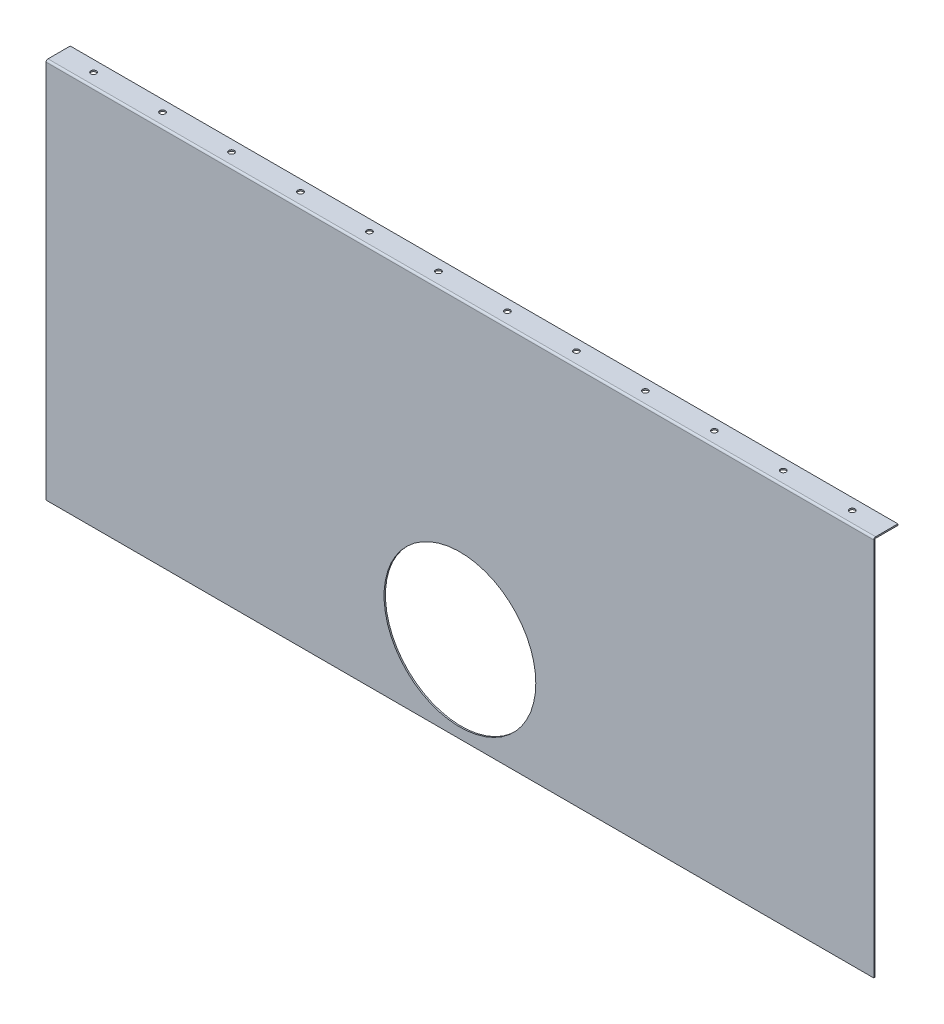
ISO-10303-21;
HEADER;
FILE_DESCRIPTION(('STEP AP214'),'2;1');
FILE_NAME('part.step','',(''),(''),'','','');
FILE_SCHEMA(('AUTOMOTIVE_DESIGN { 1 0 10303 214 1 1 1 1 }'));
ENDSEC;
DATA;
#1=APPLICATION_CONTEXT('core data for automotive mechanical design processes');
#2=APPLICATION_PROTOCOL_DEFINITION('international standard','automotive_design',2000,#1);
#3=PRODUCT_CONTEXT('',#1,'mechanical');
#4=PRODUCT('Part','Part','',(#3));
#5=PRODUCT_RELATED_PRODUCT_CATEGORY('part','',(#4));
#6=PRODUCT_DEFINITION_FORMATION('','',#4);
#7=PRODUCT_DEFINITION_CONTEXT('part definition',#1,'design');
#8=PRODUCT_DEFINITION('design','',#6,#7);
#9=PRODUCT_DEFINITION_SHAPE('','',#8);
#10=(LENGTH_UNIT() NAMED_UNIT(*) SI_UNIT(.MILLI.,.METRE.));
#11=(NAMED_UNIT(*) PLANE_ANGLE_UNIT() SI_UNIT($,.RADIAN.));
#12=(NAMED_UNIT(*) SI_UNIT($,.STERADIAN.) SOLID_ANGLE_UNIT());
#13=UNCERTAINTY_MEASURE_WITH_UNIT(LENGTH_MEASURE(1.E-05),#10,'distance_accuracy_value','');
#14=(GEOMETRIC_REPRESENTATION_CONTEXT(3) GLOBAL_UNCERTAINTY_ASSIGNED_CONTEXT((#13)) GLOBAL_UNIT_ASSIGNED_CONTEXT((#10,
#11,#12)) REPRESENTATION_CONTEXT('',''));
#15=CARTESIAN_POINT('',(0.,0.,0.));
#16=DIRECTION('',(0.,0.,1.));
#17=DIRECTION('',(1.,0.,0.));
#18=AXIS2_PLACEMENT_3D('',#15,#16,#17);
#19=CARTESIAN_POINT('',(-600.,-275.,-2.));
#20=DIRECTION('',(-1.,0.,0.));
#21=DIRECTION('',(0.,0.,1.));
#22=AXIS2_PLACEMENT_3D('',#19,#20,#21);
#23=PLANE('',#22);
#24=DIRECTION('',(0.,-1.,0.));
#25=VECTOR('',#24,1.);
#26=CARTESIAN_POINT('',(-600.,-275.,0.));
#27=LINE('',#26,#25);
#28=CARTESIAN_POINT('',(-600.,275.,0.));
#29=VERTEX_POINT('',#28);
#30=CARTESIAN_POINT('',(-600.,-275.,0.));
#31=VERTEX_POINT('',#30);
#32=EDGE_CURVE('E112',#29,#31,#27,.T.);
#33=ORIENTED_EDGE('',*,*,#32,.F.);
#34=DIRECTION('',(0.,0.,1.));
#35=VECTOR('',#34,1.);
#36=CARTESIAN_POINT('',(-600.,275.,-2.));
#37=LINE('',#36,#35);
#38=CARTESIAN_POINT('',(-600.,275.,-2.00000000000003));
#39=VERTEX_POINT('',#38);
#40=EDGE_CURVE('E13',#39,#29,#37,.T.);
#41=ORIENTED_EDGE('',*,*,#40,.F.);
#42=DIRECTION('',(0.,-1.,0.));
#43=VECTOR('',#42,1.);
#44=CARTESIAN_POINT('',(-600.,-275.,-2.));
#45=LINE('',#44,#43);
#46=CARTESIAN_POINT('',(-600.,-275.,-2.));
#47=VERTEX_POINT('',#46);
#48=EDGE_CURVE('E135',#39,#47,#45,.T.);
#49=ORIENTED_EDGE('',*,*,#48,.T.);
#50=DIRECTION('',(0.,0.,1.));
#51=VECTOR('',#50,1.);
#52=CARTESIAN_POINT('',(-600.,-275.,-2.));
#53=LINE('',#52,#51);
#54=EDGE_CURVE('E65',#47,#31,#53,.T.);
#55=ORIENTED_EDGE('',*,*,#54,.T.);
#56=EDGE_LOOP('',(#33,#41,#49,#55));
#57=FACE_BOUND('',#56,.T.);
#58=ADVANCED_FACE('F62',(#57),#23,.T.);
#59=CARTESIAN_POINT('',(600.,-275.,-2.));
#60=DIRECTION('',(1.,0.,0.));
#61=DIRECTION('',(0.,0.,-1.));
#62=AXIS2_PLACEMENT_3D('',#59,#60,#61);
#63=PLANE('',#62);
#64=DIRECTION('',(0.,1.,0.));
#65=VECTOR('',#64,1.);
#66=CARTESIAN_POINT('',(600.,-275.,0.));
#67=LINE('',#66,#65);
#68=CARTESIAN_POINT('',(600.,-275.,0.));
#69=VERTEX_POINT('',#68);
#70=CARTESIAN_POINT('',(600.,275.,0.));
#71=VERTEX_POINT('',#70);
#72=EDGE_CURVE('E133',#69,#71,#67,.T.);
#73=ORIENTED_EDGE('',*,*,#72,.F.);
#74=DIRECTION('',(0.,0.,1.));
#75=VECTOR('',#74,1.);
#76=CARTESIAN_POINT('',(600.,-275.,-2.));
#77=LINE('',#76,#75);
#78=CARTESIAN_POINT('',(600.,-275.,-2.));
#79=VERTEX_POINT('',#78);
#80=EDGE_CURVE('E81',#79,#69,#77,.T.);
#81=ORIENTED_EDGE('',*,*,#80,.F.);
#82=DIRECTION('',(0.,1.,0.));
#83=VECTOR('',#82,1.);
#84=CARTESIAN_POINT('',(600.,-275.,-2.));
#85=LINE('',#84,#83);
#86=CARTESIAN_POINT('',(600.,275.,-2.00000000000003));
#87=VERTEX_POINT('',#86);
#88=EDGE_CURVE('E155',#79,#87,#85,.T.);
#89=ORIENTED_EDGE('',*,*,#88,.T.);
#90=DIRECTION('',(0.,0.,1.));
#91=VECTOR('',#90,1.);
#92=CARTESIAN_POINT('',(600.,275.,-2.));
#93=LINE('',#92,#91);
#94=EDGE_CURVE('E72',#87,#71,#93,.T.);
#95=ORIENTED_EDGE('',*,*,#94,.T.);
#96=EDGE_LOOP('',(#73,#81,#89,#95));
#97=FACE_BOUND('',#96,.T.);
#98=ADVANCED_FACE('F345',(#97),#63,.T.);
#99=CARTESIAN_POINT('',(600.,-275.,-2.));
#100=DIRECTION('',(0.,-1.,0.));
#101=DIRECTION('',(1.,0.,0.));
#102=AXIS2_PLACEMENT_3D('',#99,#100,#101);
#103=PLANE('',#102);
#104=DIRECTION('',(1.,0.,0.));
#105=VECTOR('',#104,1.);
#106=CARTESIAN_POINT('',(600.,-275.,0.));
#107=LINE('',#106,#105);
#108=EDGE_CURVE('E129',#31,#69,#107,.T.);
#109=ORIENTED_EDGE('',*,*,#108,.F.);
#110=ORIENTED_EDGE('',*,*,#54,.F.);
#111=DIRECTION('',(1.,0.,0.));
#112=VECTOR('',#111,1.);
#113=CARTESIAN_POINT('',(600.,-275.,-2.));
#114=LINE('',#113,#112);
#115=EDGE_CURVE('E141',#47,#79,#114,.T.);
#116=ORIENTED_EDGE('',*,*,#115,.T.);
#117=ORIENTED_EDGE('',*,*,#80,.T.);
#118=EDGE_LOOP('',(#109,#110,#116,#117));
#119=FACE_BOUND('',#118,.T.);
#120=ADVANCED_FACE('F166',(#119),#103,.T.);
#121=CARTESIAN_POINT('',(0.,0.,-2.));
#122=DIRECTION('',(0.,0.,1.));
#123=DIRECTION('',(1.,0.,0.));
#124=AXIS2_PLACEMENT_3D('',#121,#122,#123);
#125=PLANE('',#124);
#126=CARTESIAN_POINT('',(0.,-150.,-2.));
#127=DIRECTION('',(0.,0.,1.));
#128=DIRECTION('',(1.,0.,0.));
#129=AXIS2_PLACEMENT_3D('',#126,#127,#128);
#130=CIRCLE('',#129,110.);
#131=CARTESIAN_POINT('',(110.,-150.,-2.));
#132=VERTEX_POINT('',#131);
#133=EDGE_CURVE('E278',#132,#132,#130,.T.);
#134=ORIENTED_EDGE('',*,*,#133,.T.);
#135=EDGE_LOOP('',(#134));
#136=FACE_BOUND('',#135,.T.);
#137=ORIENTED_EDGE('',*,*,#48,.F.);
#138=DIRECTION('',(-1.,0.,0.));
#139=VECTOR('',#138,1.);
#140=CARTESIAN_POINT('',(600.,275.,-2.));
#141=LINE('',#140,#139);
#142=EDGE_CURVE('E151',#87,#39,#141,.T.);
#143=ORIENTED_EDGE('',*,*,#142,.F.);
#144=ORIENTED_EDGE('',*,*,#88,.F.);
#145=ORIENTED_EDGE('',*,*,#115,.F.);
#146=EDGE_LOOP('',(#137,#143,#144,#145));
#147=FACE_BOUND('',#146,.T.);
#148=ADVANCED_FACE('F169',(#136,#147),#125,.F.);
#149=CARTESIAN_POINT('',(0.,0.,0.));
#150=DIRECTION('',(0.,0.,1.));
#151=DIRECTION('',(1.,0.,0.));
#152=AXIS2_PLACEMENT_3D('',#149,#150,#151);
#153=PLANE('',#152);
#154=CARTESIAN_POINT('',(0.,-150.,0.));
#155=DIRECTION('',(0.,0.,1.));
#156=DIRECTION('',(1.,0.,0.));
#157=AXIS2_PLACEMENT_3D('',#154,#155,#156);
#158=CIRCLE('',#157,110.);
#159=CARTESIAN_POINT('',(110.,-150.,0.));
#160=VERTEX_POINT('',#159);
#161=EDGE_CURVE('E324',#160,#160,#158,.T.);
#162=ORIENTED_EDGE('',*,*,#161,.F.);
#163=EDGE_LOOP('',(#162));
#164=FACE_BOUND('',#163,.T.);
#165=ORIENTED_EDGE('',*,*,#32,.T.);
#166=ORIENTED_EDGE('',*,*,#108,.T.);
#167=ORIENTED_EDGE('',*,*,#72,.T.);
#168=DIRECTION('',(-1.,0.,0.));
#169=VECTOR('',#168,1.);
#170=CARTESIAN_POINT('',(600.,275.,0.));
#171=LINE('',#170,#169);
#172=EDGE_CURVE('E103',#71,#29,#171,.T.);
#173=ORIENTED_EDGE('',*,*,#172,.T.);
#174=EDGE_LOOP('',(#165,#166,#167,#173));
#175=FACE_BOUND('',#174,.T.);
#176=ADVANCED_FACE('F132',(#164,#175),#153,.T.);
#177=CARTESIAN_POINT('',(-600.,275.,-2.73659999999995));
#178=DIRECTION('',(-1.,0.,0.));
#179=DIRECTION('',(0.,0.,1.));
#180=AXIS2_PLACEMENT_3D('',#177,#178,#179);
#181=PLANE('',#180);
#182=DIRECTION('',(0.,1.,0.));
#183=VECTOR('',#182,1.);
#184=CARTESIAN_POINT('',(-600.,277.7366,-2.73659999999997));
#185=LINE('',#184,#183);
#186=CARTESIAN_POINT('',(-600.,275.7366,-2.73659999999995));
#187=VERTEX_POINT('',#186);
#188=CARTESIAN_POINT('',(-600.,277.7366,-2.73659999999994));
#189=VERTEX_POINT('',#188);
#190=EDGE_CURVE('E181',#187,#189,#185,.T.);
#191=ORIENTED_EDGE('',*,*,#190,.F.);
#192=CARTESIAN_POINT('',(-600.,275.,-2.73659999999995));
#193=DIRECTION('',(1.,0.,0.));
#194=DIRECTION('',(0.,0.,-1.));
#195=AXIS2_PLACEMENT_3D('',#192,#193,#194);
#196=CIRCLE('',#195,0.736599999999921);
#197=EDGE_CURVE('E121',#39,#187,#196,.F.);
#198=ORIENTED_EDGE('',*,*,#197,.F.);
#199=ORIENTED_EDGE('',*,*,#40,.T.);
#200=CARTESIAN_POINT('',(-600.,275.,-2.73659999999995));
#201=DIRECTION('',(1.,0.,0.));
#202=DIRECTION('',(0.,0.,-1.));
#203=AXIS2_PLACEMENT_3D('',#200,#201,#202);
#204=CIRCLE('',#203,2.73659999999992);
#205=EDGE_CURVE('E99',#29,#189,#204,.F.);
#206=ORIENTED_EDGE('',*,*,#205,.T.);
#207=EDGE_LOOP('',(#191,#198,#199,#206));
#208=FACE_BOUND('',#207,.T.);
#209=ADVANCED_FACE('F118',(#208),#181,.T.);
#210=CARTESIAN_POINT('',(600.,275.,-2.73659999999995));
#211=DIRECTION('',(-1.,0.,0.));
#212=DIRECTION('',(0.,0.,1.));
#213=AXIS2_PLACEMENT_3D('',#210,#211,#212);
#214=PLANE('',#213);
#215=CARTESIAN_POINT('',(600.,275.,-2.73659999999995));
#216=DIRECTION('',(1.,0.,0.));
#217=DIRECTION('',(0.,0.,-1.));
#218=AXIS2_PLACEMENT_3D('',#215,#216,#217);
#219=CIRCLE('',#218,0.736599999999921);
#220=CARTESIAN_POINT('',(600.,275.7366,-2.73659999999995));
#221=VERTEX_POINT('',#220);
#222=EDGE_CURVE('E173',#221,#87,#219,.T.);
#223=ORIENTED_EDGE('',*,*,#222,.F.);
#224=DIRECTION('',(0.,1.,0.));
#225=VECTOR('',#224,1.);
#226=CARTESIAN_POINT('',(600.,275.7366,-2.73659999999992));
#227=LINE('',#226,#225);
#228=CARTESIAN_POINT('',(600.,277.7366,-2.73659999999992));
#229=VERTEX_POINT('',#228);
#230=EDGE_CURVE('E188',#221,#229,#227,.T.);
#231=ORIENTED_EDGE('',*,*,#230,.T.);
#232=CARTESIAN_POINT('',(600.,275.,-2.73659999999995));
#233=DIRECTION('',(1.,0.,0.));
#234=DIRECTION('',(0.,0.,-1.));
#235=AXIS2_PLACEMENT_3D('',#232,#233,#234);
#236=CIRCLE('',#235,2.73659999999992);
#237=EDGE_CURVE('E113',#229,#71,#236,.T.);
#238=ORIENTED_EDGE('',*,*,#237,.T.);
#239=ORIENTED_EDGE('',*,*,#94,.F.);
#240=EDGE_LOOP('',(#223,#231,#238,#239));
#241=FACE_BOUND('',#240,.T.);
#242=ADVANCED_FACE('F339',(#241),#214,.F.);
#243=CARTESIAN_POINT('',(600.,275.,-2.73659999999995));
#244=DIRECTION('',(1.,0.,0.));
#245=DIRECTION('',(0.,1.,0.));
#246=AXIS2_PLACEMENT_3D('',#243,#244,#245);
#247=CYLINDRICAL_SURFACE('',#246,2.73659999999992);
#248=ORIENTED_EDGE('',*,*,#172,.F.);
#249=ORIENTED_EDGE('',*,*,#237,.F.);
#250=DIRECTION('',(1.,0.,0.));
#251=VECTOR('',#250,1.);
#252=CARTESIAN_POINT('',(0.,277.7366,-2.73659999999994));
#253=LINE('',#252,#251);
#254=EDGE_CURVE('E107',#189,#229,#253,.T.);
#255=ORIENTED_EDGE('',*,*,#254,.F.);
#256=ORIENTED_EDGE('',*,*,#205,.F.);
#257=EDGE_LOOP('',(#248,#249,#255,#256));
#258=FACE_BOUND('',#257,.T.);
#259=ADVANCED_FACE('F100',(#258),#247,.T.);
#260=CARTESIAN_POINT('',(600.,275.,-2.73659999999995));
#261=DIRECTION('',(1.,0.,0.));
#262=DIRECTION('',(0.,1.,0.));
#263=AXIS2_PLACEMENT_3D('',#260,#261,#262);
#264=CYLINDRICAL_SURFACE('',#263,0.736599999999921);
#265=ORIENTED_EDGE('',*,*,#142,.T.);
#266=ORIENTED_EDGE('',*,*,#197,.T.);
#267=DIRECTION('',(-1.,0.,0.));
#268=VECTOR('',#267,1.);
#269=CARTESIAN_POINT('',(-600.,275.7366,-2.73659999999998));
#270=LINE('',#269,#268);
#271=EDGE_CURVE('E183',#187,#221,#270,.F.);
#272=ORIENTED_EDGE('',*,*,#271,.T.);
#273=ORIENTED_EDGE('',*,*,#222,.T.);
#274=EDGE_LOOP('',(#265,#266,#272,#273));
#275=FACE_BOUND('',#274,.T.);
#276=ADVANCED_FACE('F359',(#275),#264,.F.);
#277=CARTESIAN_POINT('',(600.,277.7366,-1.99999999999999));
#278=DIRECTION('',(1.,0.,0.));
#279=DIRECTION('',(0.,0.,-1.));
#280=AXIS2_PLACEMENT_3D('',#277,#278,#279);
#281=PLANE('',#280);
#282=DIRECTION('',(0.,0.,1.));
#283=VECTOR('',#282,1.);
#284=CARTESIAN_POINT('',(600.,277.7366,-1.99999999999999));
#285=LINE('',#284,#283);
#286=CARTESIAN_POINT('',(600.,277.7366,-35.));
#287=VERTEX_POINT('',#286);
#288=EDGE_CURVE('E214',#287,#229,#285,.T.);
#289=ORIENTED_EDGE('',*,*,#288,.T.);
#290=ORIENTED_EDGE('',*,*,#230,.F.);
#291=DIRECTION('',(0.,0.,-1.));
#292=VECTOR('',#291,1.);
#293=CARTESIAN_POINT('',(600.,275.7366,-3.11198878114627E-12));
#294=LINE('',#293,#292);
#295=CARTESIAN_POINT('',(600.,275.7366,-35.));
#296=VERTEX_POINT('',#295);
#297=EDGE_CURVE('E202',#296,#221,#294,.F.);
#298=ORIENTED_EDGE('',*,*,#297,.F.);
#299=DIRECTION('',(0.,-1.,0.));
#300=VECTOR('',#299,1.);
#301=CARTESIAN_POINT('',(600.,277.7366,-35.));
#302=LINE('',#301,#300);
#303=EDGE_CURVE('E176',#287,#296,#302,.T.);
#304=ORIENTED_EDGE('',*,*,#303,.F.);
#305=EDGE_LOOP('',(#289,#290,#298,#304));
#306=FACE_BOUND('',#305,.T.);
#307=ADVANCED_FACE('F384',(#306),#281,.T.);
#308=CARTESIAN_POINT('',(-600.,277.7366,-35.));
#309=DIRECTION('',(-1.,0.,0.));
#310=DIRECTION('',(0.,0.,1.));
#311=AXIS2_PLACEMENT_3D('',#308,#309,#310);
#312=PLANE('',#311);
#313=DIRECTION('',(0.,0.,1.));
#314=VECTOR('',#313,1.);
#315=CARTESIAN_POINT('',(-600.,275.7366,4.96236048885487E-12));
#316=LINE('',#315,#314);
#317=CARTESIAN_POINT('',(-600.,275.7366,-35.));
#318=VERTEX_POINT('',#317);
#319=EDGE_CURVE('E194',#187,#318,#316,.F.);
#320=ORIENTED_EDGE('',*,*,#319,.F.);
#321=ORIENTED_EDGE('',*,*,#190,.T.);
#322=DIRECTION('',(0.,0.,-1.));
#323=VECTOR('',#322,1.);
#324=CARTESIAN_POINT('',(-600.,277.7366,-35.));
#325=LINE('',#324,#323);
#326=CARTESIAN_POINT('',(-600.,277.7366,-35.));
#327=VERTEX_POINT('',#326);
#328=EDGE_CURVE('E206',#189,#327,#325,.T.);
#329=ORIENTED_EDGE('',*,*,#328,.T.);
#330=DIRECTION('',(0.,-1.,0.));
#331=VECTOR('',#330,1.);
#332=CARTESIAN_POINT('',(-600.,277.7366,-35.));
#333=LINE('',#332,#331);
#334=EDGE_CURVE('E218',#327,#318,#333,.T.);
#335=ORIENTED_EDGE('',*,*,#334,.T.);
#336=EDGE_LOOP('',(#320,#321,#329,#335));
#337=FACE_BOUND('',#336,.T.);
#338=ADVANCED_FACE('F371',(#337),#312,.T.);
#339=CARTESIAN_POINT('',(0.,277.7366,9.32168816531984E-13));
#340=DIRECTION('',(0.,1.,0.));
#341=DIRECTION('',(0.,0.,1.));
#342=AXIS2_PLACEMENT_3D('',#339,#340,#341);
#343=PLANE('',#342);
#344=CARTESIAN_POINT('',(-550.,277.7366,-18.8682999999999));
#345=DIRECTION('',(0.,1.,0.));
#346=DIRECTION('',(0.,0.,1.));
#347=AXIS2_PLACEMENT_3D('',#344,#345,#346);
#348=CIRCLE('',#347,3.99999999999999);
#349=CARTESIAN_POINT('',(-550.,277.7366,-14.8682999999999));
#350=VERTEX_POINT('',#349);
#351=EDGE_CURVE('E184',#350,#350,#348,.T.);
#352=ORIENTED_EDGE('',*,*,#351,.F.);
#353=EDGE_LOOP('',(#352));
#354=FACE_BOUND('',#353,.T.);
#355=CARTESIAN_POINT('',(-450.,277.7366,-18.8682999999999));
#356=DIRECTION('',(0.,1.,0.));
#357=DIRECTION('',(0.,0.,1.));
#358=AXIS2_PLACEMENT_3D('',#355,#356,#357);
#359=CIRCLE('',#358,3.99999999999999);
#360=CARTESIAN_POINT('',(-450.,277.7366,-14.8682999999999));
#361=VERTEX_POINT('',#360);
#362=EDGE_CURVE('E228',#361,#361,#359,.T.);
#363=ORIENTED_EDGE('',*,*,#362,.F.);
#364=EDGE_LOOP('',(#363));
#365=FACE_BOUND('',#364,.T.);
#366=CARTESIAN_POINT('',(-350.,277.7366,-18.8682999999999));
#367=DIRECTION('',(0.,1.,0.));
#368=DIRECTION('',(0.,0.,1.));
#369=AXIS2_PLACEMENT_3D('',#366,#367,#368);
#370=CIRCLE('',#369,3.99999999999999);
#371=CARTESIAN_POINT('',(-350.,277.7366,-14.8682999999999));
#372=VERTEX_POINT('',#371);
#373=EDGE_CURVE('E232',#372,#372,#370,.T.);
#374=ORIENTED_EDGE('',*,*,#373,.F.);
#375=EDGE_LOOP('',(#374));
#376=FACE_BOUND('',#375,.T.);
#377=CARTESIAN_POINT('',(-250.,277.7366,-18.8682999999999));
#378=DIRECTION('',(0.,1.,0.));
#379=DIRECTION('',(0.,0.,1.));
#380=AXIS2_PLACEMENT_3D('',#377,#378,#379);
#381=CIRCLE('',#380,3.99999999999997);
#382=CARTESIAN_POINT('',(-250.,277.7366,-14.8682999999999));
#383=VERTEX_POINT('',#382);
#384=EDGE_CURVE('E236',#383,#383,#381,.T.);
#385=ORIENTED_EDGE('',*,*,#384,.F.);
#386=EDGE_LOOP('',(#385));
#387=FACE_BOUND('',#386,.T.);
#388=CARTESIAN_POINT('',(-150.,277.7366,-18.8682999999999));
#389=DIRECTION('',(0.,1.,0.));
#390=DIRECTION('',(0.,0.,1.));
#391=AXIS2_PLACEMENT_3D('',#388,#389,#390);
#392=CIRCLE('',#391,3.99999999999999);
#393=CARTESIAN_POINT('',(-150.,277.7366,-14.8682999999999));
#394=VERTEX_POINT('',#393);
#395=EDGE_CURVE('E240',#394,#394,#392,.T.);
#396=ORIENTED_EDGE('',*,*,#395,.F.);
#397=EDGE_LOOP('',(#396));
#398=FACE_BOUND('',#397,.T.);
#399=CARTESIAN_POINT('',(-50.0000000000002,277.7366,-18.8682999999999));
#400=DIRECTION('',(0.,1.,0.));
#401=DIRECTION('',(0.,0.,1.));
#402=AXIS2_PLACEMENT_3D('',#399,#400,#401);
#403=CIRCLE('',#402,3.99999999999999);
#404=CARTESIAN_POINT('',(-50.0000000000002,277.7366,-14.8682999999999));
#405=VERTEX_POINT('',#404);
#406=EDGE_CURVE('E244',#405,#405,#403,.T.);
#407=ORIENTED_EDGE('',*,*,#406,.F.);
#408=EDGE_LOOP('',(#407));
#409=FACE_BOUND('',#408,.T.);
#410=CARTESIAN_POINT('',(49.9999999999998,277.7366,-18.8682999999999));
#411=DIRECTION('',(0.,1.,0.));
#412=DIRECTION('',(0.,0.,1.));
#413=AXIS2_PLACEMENT_3D('',#410,#411,#412);
#414=CIRCLE('',#413,3.99999999999999);
#415=CARTESIAN_POINT('',(49.9999999999998,277.7366,-14.8682999999999));
#416=VERTEX_POINT('',#415);
#417=EDGE_CURVE('E248',#416,#416,#414,.T.);
#418=ORIENTED_EDGE('',*,*,#417,.F.);
#419=EDGE_LOOP('',(#418));
#420=FACE_BOUND('',#419,.T.);
#421=CARTESIAN_POINT('',(150.,277.7366,-18.8682999999999));
#422=DIRECTION('',(0.,1.,0.));
#423=DIRECTION('',(0.,0.,1.));
#424=AXIS2_PLACEMENT_3D('',#421,#422,#423);
#425=CIRCLE('',#424,3.99999999999999);
#426=CARTESIAN_POINT('',(150.,277.7366,-14.8682999999999));
#427=VERTEX_POINT('',#426);
#428=EDGE_CURVE('E252',#427,#427,#425,.T.);
#429=ORIENTED_EDGE('',*,*,#428,.F.);
#430=EDGE_LOOP('',(#429));
#431=FACE_BOUND('',#430,.T.);
#432=CARTESIAN_POINT('',(250.,277.7366,-18.8682999999999));
#433=DIRECTION('',(0.,1.,0.));
#434=DIRECTION('',(0.,0.,1.));
#435=AXIS2_PLACEMENT_3D('',#432,#433,#434);
#436=CIRCLE('',#435,4.00000000000002);
#437=CARTESIAN_POINT('',(250.,277.7366,-14.8682999999999));
#438=VERTEX_POINT('',#437);
#439=EDGE_CURVE('E256',#438,#438,#436,.T.);
#440=ORIENTED_EDGE('',*,*,#439,.F.);
#441=EDGE_LOOP('',(#440));
#442=FACE_BOUND('',#441,.T.);
#443=CARTESIAN_POINT('',(350.,277.7366,-18.8682999999999));
#444=DIRECTION('',(0.,1.,0.));
#445=DIRECTION('',(0.,0.,1.));
#446=AXIS2_PLACEMENT_3D('',#443,#444,#445);
#447=CIRCLE('',#446,3.99999999999999);
#448=CARTESIAN_POINT('',(350.,277.7366,-14.8682999999999));
#449=VERTEX_POINT('',#448);
#450=EDGE_CURVE('E260',#449,#449,#447,.T.);
#451=ORIENTED_EDGE('',*,*,#450,.F.);
#452=EDGE_LOOP('',(#451));
#453=FACE_BOUND('',#452,.T.);
#454=CARTESIAN_POINT('',(450.,277.7366,-18.8682999999999));
#455=DIRECTION('',(0.,1.,0.));
#456=DIRECTION('',(0.,0.,1.));
#457=AXIS2_PLACEMENT_3D('',#454,#455,#456);
#458=CIRCLE('',#457,3.99999999999999);
#459=CARTESIAN_POINT('',(450.,277.7366,-14.8682999999999));
#460=VERTEX_POINT('',#459);
#461=EDGE_CURVE('E264',#460,#460,#458,.T.);
#462=ORIENTED_EDGE('',*,*,#461,.F.);
#463=EDGE_LOOP('',(#462));
#464=FACE_BOUND('',#463,.T.);
#465=CARTESIAN_POINT('',(550.,277.7366,-18.8682999999999));
#466=DIRECTION('',(0.,1.,0.));
#467=DIRECTION('',(0.,0.,1.));
#468=AXIS2_PLACEMENT_3D('',#465,#466,#467);
#469=CIRCLE('',#468,3.99999999999999);
#470=CARTESIAN_POINT('',(550.,277.7366,-14.8682999999999));
#471=VERTEX_POINT('',#470);
#472=EDGE_CURVE('E268',#471,#471,#469,.T.);
#473=ORIENTED_EDGE('',*,*,#472,.F.);
#474=EDGE_LOOP('',(#473));
#475=FACE_BOUND('',#474,.T.);
#476=ORIENTED_EDGE('',*,*,#328,.F.);
#477=ORIENTED_EDGE('',*,*,#254,.T.);
#478=ORIENTED_EDGE('',*,*,#288,.F.);
#479=DIRECTION('',(1.,0.,0.));
#480=VECTOR('',#479,1.);
#481=CARTESIAN_POINT('',(600.,277.7366,-35.));
#482=LINE('',#481,#480);
#483=EDGE_CURVE('E210',#327,#287,#482,.T.);
#484=ORIENTED_EDGE('',*,*,#483,.F.);
#485=EDGE_LOOP('',(#476,#477,#478,#484));
#486=FACE_BOUND('',#485,.T.);
#487=ADVANCED_FACE('F389',(#354,#365,#376,#387,#398,#409,#420,#431,#442,#453,#464,#475,#486),
#343,.T.);
#488=CARTESIAN_POINT('',(0.,275.7366,9.25185853854297E-13));
#489=DIRECTION('',(0.,1.,0.));
#490=DIRECTION('',(0.,0.,1.));
#491=AXIS2_PLACEMENT_3D('',#488,#489,#490);
#492=PLANE('',#491);
#493=CARTESIAN_POINT('',(-550.,275.7366,-18.8682999999999));
#494=DIRECTION('',(0.,-1.,0.));
#495=DIRECTION('',(0.,0.,-1.));
#496=AXIS2_PLACEMENT_3D('',#493,#494,#495);
#497=CIRCLE('',#496,3.99999999999999);
#498=CARTESIAN_POINT('',(-550.,275.7366,-22.8682999999999));
#499=VERTEX_POINT('',#498);
#500=EDGE_CURVE('E272',#499,#499,#497,.T.);
#501=ORIENTED_EDGE('',*,*,#500,.F.);
#502=EDGE_LOOP('',(#501));
#503=FACE_BOUND('',#502,.T.);
#504=CARTESIAN_POINT('',(-450.,275.7366,-18.8682999999999));
#505=DIRECTION('',(0.,-1.,0.));
#506=DIRECTION('',(0.,0.,-1.));
#507=AXIS2_PLACEMENT_3D('',#504,#505,#506);
#508=CIRCLE('',#507,3.99999999999999);
#509=CARTESIAN_POINT('',(-450.,275.7366,-22.8682999999999));
#510=VERTEX_POINT('',#509);
#511=EDGE_CURVE('E314',#510,#510,#508,.T.);
#512=ORIENTED_EDGE('',*,*,#511,.F.);
#513=EDGE_LOOP('',(#512));
#514=FACE_BOUND('',#513,.T.);
#515=CARTESIAN_POINT('',(-350.,275.7366,-18.8682999999999));
#516=DIRECTION('',(0.,-1.,0.));
#517=DIRECTION('',(0.,0.,-1.));
#518=AXIS2_PLACEMENT_3D('',#515,#516,#517);
#519=CIRCLE('',#518,3.99999999999999);
#520=CARTESIAN_POINT('',(-350.,275.7366,-22.8682999999999));
#521=VERTEX_POINT('',#520);
#522=EDGE_CURVE('E310',#521,#521,#519,.T.);
#523=ORIENTED_EDGE('',*,*,#522,.F.);
#524=EDGE_LOOP('',(#523));
#525=FACE_BOUND('',#524,.T.);
#526=CARTESIAN_POINT('',(-250.,275.7366,-18.8682999999999));
#527=DIRECTION('',(0.,-1.,0.));
#528=DIRECTION('',(0.,0.,-1.));
#529=AXIS2_PLACEMENT_3D('',#526,#527,#528);
#530=CIRCLE('',#529,3.99999999999997);
#531=CARTESIAN_POINT('',(-250.,275.7366,-22.8682999999999));
#532=VERTEX_POINT('',#531);
#533=EDGE_CURVE('E306',#532,#532,#530,.T.);
#534=ORIENTED_EDGE('',*,*,#533,.F.);
#535=EDGE_LOOP('',(#534));
#536=FACE_BOUND('',#535,.T.);
#537=CARTESIAN_POINT('',(-150.,275.7366,-18.8682999999999));
#538=DIRECTION('',(0.,-1.,0.));
#539=DIRECTION('',(0.,0.,-1.));
#540=AXIS2_PLACEMENT_3D('',#537,#538,#539);
#541=CIRCLE('',#540,3.99999999999999);
#542=CARTESIAN_POINT('',(-150.,275.7366,-22.8682999999999));
#543=VERTEX_POINT('',#542);
#544=EDGE_CURVE('E302',#543,#543,#541,.T.);
#545=ORIENTED_EDGE('',*,*,#544,.F.);
#546=EDGE_LOOP('',(#545));
#547=FACE_BOUND('',#546,.T.);
#548=CARTESIAN_POINT('',(-50.0000000000002,275.7366,-18.8682999999999));
#549=DIRECTION('',(0.,-1.,0.));
#550=DIRECTION('',(0.,0.,-1.));
#551=AXIS2_PLACEMENT_3D('',#548,#549,#550);
#552=CIRCLE('',#551,3.99999999999999);
#553=CARTESIAN_POINT('',(-50.0000000000002,275.7366,-22.8682999999999));
#554=VERTEX_POINT('',#553);
#555=EDGE_CURVE('E298',#554,#554,#552,.T.);
#556=ORIENTED_EDGE('',*,*,#555,.F.);
#557=EDGE_LOOP('',(#556));
#558=FACE_BOUND('',#557,.T.);
#559=CARTESIAN_POINT('',(49.9999999999998,275.7366,-18.8682999999999));
#560=DIRECTION('',(0.,-1.,0.));
#561=DIRECTION('',(0.,0.,-1.));
#562=AXIS2_PLACEMENT_3D('',#559,#560,#561);
#563=CIRCLE('',#562,3.99999999999999);
#564=CARTESIAN_POINT('',(49.9999999999998,275.7366,-22.8682999999999));
#565=VERTEX_POINT('',#564);
#566=EDGE_CURVE('E294',#565,#565,#563,.T.);
#567=ORIENTED_EDGE('',*,*,#566,.F.);
#568=EDGE_LOOP('',(#567));
#569=FACE_BOUND('',#568,.T.);
#570=CARTESIAN_POINT('',(150.,275.7366,-18.8682999999999));
#571=DIRECTION('',(0.,-1.,0.));
#572=DIRECTION('',(0.,0.,-1.));
#573=AXIS2_PLACEMENT_3D('',#570,#571,#572);
#574=CIRCLE('',#573,3.99999999999999);
#575=CARTESIAN_POINT('',(150.,275.7366,-22.8682999999999));
#576=VERTEX_POINT('',#575);
#577=EDGE_CURVE('E290',#576,#576,#574,.T.);
#578=ORIENTED_EDGE('',*,*,#577,.F.);
#579=EDGE_LOOP('',(#578));
#580=FACE_BOUND('',#579,.T.);
#581=CARTESIAN_POINT('',(250.,275.7366,-18.8682999999999));
#582=DIRECTION('',(0.,-1.,0.));
#583=DIRECTION('',(0.,0.,-1.));
#584=AXIS2_PLACEMENT_3D('',#581,#582,#583);
#585=CIRCLE('',#584,4.00000000000002);
#586=CARTESIAN_POINT('',(250.,275.7366,-22.8682999999999));
#587=VERTEX_POINT('',#586);
#588=EDGE_CURVE('E286',#587,#587,#585,.T.);
#589=ORIENTED_EDGE('',*,*,#588,.F.);
#590=EDGE_LOOP('',(#589));
#591=FACE_BOUND('',#590,.T.);
#592=CARTESIAN_POINT('',(350.,275.7366,-18.8682999999999));
#593=DIRECTION('',(0.,-1.,0.));
#594=DIRECTION('',(0.,0.,-1.));
#595=AXIS2_PLACEMENT_3D('',#592,#593,#594);
#596=CIRCLE('',#595,3.99999999999999);
#597=CARTESIAN_POINT('',(350.,275.7366,-22.8682999999999));
#598=VERTEX_POINT('',#597);
#599=EDGE_CURVE('E282',#598,#598,#596,.T.);
#600=ORIENTED_EDGE('',*,*,#599,.F.);
#601=EDGE_LOOP('',(#600));
#602=FACE_BOUND('',#601,.T.);
#603=CARTESIAN_POINT('',(450.,275.7366,-18.8682999999999));
#604=DIRECTION('',(0.,-1.,0.));
#605=DIRECTION('',(0.,0.,-1.));
#606=AXIS2_PLACEMENT_3D('',#603,#604,#605);
#607=CIRCLE('',#606,3.99999999999999);
#608=CARTESIAN_POINT('',(450.,275.7366,-22.8682999999999));
#609=VERTEX_POINT('',#608);
#610=EDGE_CURVE('E277',#609,#609,#607,.T.);
#611=ORIENTED_EDGE('',*,*,#610,.F.);
#612=EDGE_LOOP('',(#611));
#613=FACE_BOUND('',#612,.T.);
#614=CARTESIAN_POINT('',(550.,275.7366,-18.8682999999999));
#615=DIRECTION('',(0.,-1.,0.));
#616=DIRECTION('',(0.,0.,-1.));
#617=AXIS2_PLACEMENT_3D('',#614,#615,#616);
#618=CIRCLE('',#617,3.99999999999999);
#619=CARTESIAN_POINT('',(550.,275.7366,-22.8682999999999));
#620=VERTEX_POINT('',#619);
#621=EDGE_CURVE('E273',#620,#620,#618,.T.);
#622=ORIENTED_EDGE('',*,*,#621,.F.);
#623=EDGE_LOOP('',(#622));
#624=FACE_BOUND('',#623,.T.);
#625=ORIENTED_EDGE('',*,*,#271,.F.);
#626=ORIENTED_EDGE('',*,*,#319,.T.);
#627=DIRECTION('',(-1.,0.,0.));
#628=VECTOR('',#627,1.);
#629=CARTESIAN_POINT('',(0.,275.7366,-35.));
#630=LINE('',#629,#628);
#631=EDGE_CURVE('E198',#318,#296,#630,.F.);
#632=ORIENTED_EDGE('',*,*,#631,.T.);
#633=ORIENTED_EDGE('',*,*,#297,.T.);
#634=EDGE_LOOP('',(#625,#626,#632,#633));
#635=FACE_BOUND('',#634,.T.);
#636=ADVANCED_FACE('F364',(#503,#514,#525,#536,#547,#558,#569,#580,#591,#602,#613,#624,#635),
#492,.F.);
#637=CARTESIAN_POINT('',(600.,277.7366,-35.));
#638=DIRECTION('',(0.,0.,-1.));
#639=DIRECTION('',(0.,1.,0.));
#640=AXIS2_PLACEMENT_3D('',#637,#638,#639);
#641=PLANE('',#640);
#642=ORIENTED_EDGE('',*,*,#631,.F.);
#643=ORIENTED_EDGE('',*,*,#334,.F.);
#644=ORIENTED_EDGE('',*,*,#483,.T.);
#645=ORIENTED_EDGE('',*,*,#303,.T.);
#646=EDGE_LOOP('',(#642,#643,#644,#645));
#647=FACE_BOUND('',#646,.T.);
#648=ADVANCED_FACE('F380',(#647),#641,.T.);
#649=CARTESIAN_POINT('',(550.,278.7366,-18.8682999999999));
#650=DIRECTION('',(0.,-1.,0.));
#651=DIRECTION('',(0.,0.,-1.));
#652=AXIS2_PLACEMENT_3D('',#649,#650,#651);
#653=CYLINDRICAL_SURFACE('',#652,3.99999999999999);
#654=ORIENTED_EDGE('',*,*,#472,.T.);
#655=EDGE_LOOP('',(#654));
#656=FACE_BOUND('',#655,.T.);
#657=ORIENTED_EDGE('',*,*,#621,.T.);
#658=EDGE_LOOP('',(#657));
#659=FACE_BOUND('',#658,.T.);
#660=ADVANCED_FACE('F407',(#656,#659),#653,.F.);
#661=CARTESIAN_POINT('',(450.,278.7366,-18.8682999999999));
#662=DIRECTION('',(0.,-1.,0.));
#663=DIRECTION('',(0.,0.,-1.));
#664=AXIS2_PLACEMENT_3D('',#661,#662,#663);
#665=CYLINDRICAL_SURFACE('',#664,3.99999999999999);
#666=ORIENTED_EDGE('',*,*,#461,.T.);
#667=EDGE_LOOP('',(#666));
#668=FACE_BOUND('',#667,.T.);
#669=ORIENTED_EDGE('',*,*,#610,.T.);
#670=EDGE_LOOP('',(#669));
#671=FACE_BOUND('',#670,.T.);
#672=ADVANCED_FACE('F468',(#668,#671),#665,.F.);
#673=CARTESIAN_POINT('',(350.,278.7366,-18.8682999999999));
#674=DIRECTION('',(0.,-1.,0.));
#675=DIRECTION('',(0.,0.,-1.));
#676=AXIS2_PLACEMENT_3D('',#673,#674,#675);
#677=CYLINDRICAL_SURFACE('',#676,3.99999999999999);
#678=ORIENTED_EDGE('',*,*,#450,.T.);
#679=EDGE_LOOP('',(#678));
#680=FACE_BOUND('',#679,.T.);
#681=ORIENTED_EDGE('',*,*,#599,.T.);
#682=EDGE_LOOP('',(#681));
#683=FACE_BOUND('',#682,.T.);
#684=ADVANCED_FACE('F478',(#680,#683),#677,.F.);
#685=CARTESIAN_POINT('',(250.,278.7366,-18.8682999999999));
#686=DIRECTION('',(0.,-1.,0.));
#687=DIRECTION('',(0.,0.,-1.));
#688=AXIS2_PLACEMENT_3D('',#685,#686,#687);
#689=CYLINDRICAL_SURFACE('',#688,4.00000000000002);
#690=ORIENTED_EDGE('',*,*,#439,.T.);
#691=EDGE_LOOP('',(#690));
#692=FACE_BOUND('',#691,.T.);
#693=ORIENTED_EDGE('',*,*,#588,.T.);
#694=EDGE_LOOP('',(#693));
#695=FACE_BOUND('',#694,.T.);
#696=ADVANCED_FACE('F488',(#692,#695),#689,.F.);
#697=CARTESIAN_POINT('',(150.,278.7366,-18.8682999999999));
#698=DIRECTION('',(0.,-1.,0.));
#699=DIRECTION('',(0.,0.,-1.));
#700=AXIS2_PLACEMENT_3D('',#697,#698,#699);
#701=CYLINDRICAL_SURFACE('',#700,3.99999999999999);
#702=ORIENTED_EDGE('',*,*,#428,.T.);
#703=EDGE_LOOP('',(#702));
#704=FACE_BOUND('',#703,.T.);
#705=ORIENTED_EDGE('',*,*,#577,.T.);
#706=EDGE_LOOP('',(#705));
#707=FACE_BOUND('',#706,.T.);
#708=ADVANCED_FACE('F499',(#704,#707),#701,.F.);
#709=CARTESIAN_POINT('',(49.9999999999998,278.7366,-18.8682999999999));
#710=DIRECTION('',(0.,-1.,0.));
#711=DIRECTION('',(0.,0.,-1.));
#712=AXIS2_PLACEMENT_3D('',#709,#710,#711);
#713=CYLINDRICAL_SURFACE('',#712,3.99999999999999);
#714=ORIENTED_EDGE('',*,*,#417,.T.);
#715=EDGE_LOOP('',(#714));
#716=FACE_BOUND('',#715,.T.);
#717=ORIENTED_EDGE('',*,*,#566,.T.);
#718=EDGE_LOOP('',(#717));
#719=FACE_BOUND('',#718,.T.);
#720=ADVANCED_FACE('F510',(#716,#719),#713,.F.);
#721=CARTESIAN_POINT('',(-50.0000000000002,278.7366,-18.8682999999999));
#722=DIRECTION('',(0.,-1.,0.));
#723=DIRECTION('',(0.,0.,-1.));
#724=AXIS2_PLACEMENT_3D('',#721,#722,#723);
#725=CYLINDRICAL_SURFACE('',#724,3.99999999999999);
#726=ORIENTED_EDGE('',*,*,#406,.T.);
#727=EDGE_LOOP('',(#726));
#728=FACE_BOUND('',#727,.T.);
#729=ORIENTED_EDGE('',*,*,#555,.T.);
#730=EDGE_LOOP('',(#729));
#731=FACE_BOUND('',#730,.T.);
#732=ADVANCED_FACE('F521',(#728,#731),#725,.F.);
#733=CARTESIAN_POINT('',(-150.,278.7366,-18.8682999999999));
#734=DIRECTION('',(0.,-1.,0.));
#735=DIRECTION('',(0.,0.,-1.));
#736=AXIS2_PLACEMENT_3D('',#733,#734,#735);
#737=CYLINDRICAL_SURFACE('',#736,3.99999999999999);
#738=ORIENTED_EDGE('',*,*,#395,.T.);
#739=EDGE_LOOP('',(#738));
#740=FACE_BOUND('',#739,.T.);
#741=ORIENTED_EDGE('',*,*,#544,.T.);
#742=EDGE_LOOP('',(#741));
#743=FACE_BOUND('',#742,.T.);
#744=ADVANCED_FACE('F532',(#740,#743),#737,.F.);
#745=CARTESIAN_POINT('',(-250.,278.7366,-18.8682999999999));
#746=DIRECTION('',(0.,-1.,0.));
#747=DIRECTION('',(0.,0.,-1.));
#748=AXIS2_PLACEMENT_3D('',#745,#746,#747);
#749=CYLINDRICAL_SURFACE('',#748,3.99999999999997);
#750=ORIENTED_EDGE('',*,*,#384,.T.);
#751=EDGE_LOOP('',(#750));
#752=FACE_BOUND('',#751,.T.);
#753=ORIENTED_EDGE('',*,*,#533,.T.);
#754=EDGE_LOOP('',(#753));
#755=FACE_BOUND('',#754,.T.);
#756=ADVANCED_FACE('F543',(#752,#755),#749,.F.);
#757=CARTESIAN_POINT('',(-350.,278.7366,-18.8682999999999));
#758=DIRECTION('',(0.,-1.,0.));
#759=DIRECTION('',(0.,0.,-1.));
#760=AXIS2_PLACEMENT_3D('',#757,#758,#759);
#761=CYLINDRICAL_SURFACE('',#760,3.99999999999999);
#762=ORIENTED_EDGE('',*,*,#373,.T.);
#763=EDGE_LOOP('',(#762));
#764=FACE_BOUND('',#763,.T.);
#765=ORIENTED_EDGE('',*,*,#522,.T.);
#766=EDGE_LOOP('',(#765));
#767=FACE_BOUND('',#766,.T.);
#768=ADVANCED_FACE('F554',(#764,#767),#761,.F.);
#769=CARTESIAN_POINT('',(-450.,278.7366,-18.8682999999999));
#770=DIRECTION('',(0.,-1.,0.));
#771=DIRECTION('',(0.,0.,-1.));
#772=AXIS2_PLACEMENT_3D('',#769,#770,#771);
#773=CYLINDRICAL_SURFACE('',#772,3.99999999999999);
#774=ORIENTED_EDGE('',*,*,#362,.T.);
#775=EDGE_LOOP('',(#774));
#776=FACE_BOUND('',#775,.T.);
#777=ORIENTED_EDGE('',*,*,#511,.T.);
#778=EDGE_LOOP('',(#777));
#779=FACE_BOUND('',#778,.T.);
#780=ADVANCED_FACE('F565',(#776,#779),#773,.F.);
#781=CARTESIAN_POINT('',(-550.,278.7366,-18.8682999999999));
#782=DIRECTION('',(0.,-1.,0.));
#783=DIRECTION('',(0.,0.,-1.));
#784=AXIS2_PLACEMENT_3D('',#781,#782,#783);
#785=CYLINDRICAL_SURFACE('',#784,3.99999999999999);
#786=ORIENTED_EDGE('',*,*,#351,.T.);
#787=EDGE_LOOP('',(#786));
#788=FACE_BOUND('',#787,.T.);
#789=ORIENTED_EDGE('',*,*,#500,.T.);
#790=EDGE_LOOP('',(#789));
#791=FACE_BOUND('',#790,.T.);
#792=ADVANCED_FACE('F576',(#788,#791),#785,.F.);
#793=CARTESIAN_POINT('',(0.,-150.,-3.));
#794=DIRECTION('',(0.,0.,1.));
#795=DIRECTION('',(1.,0.,0.));
#796=AXIS2_PLACEMENT_3D('',#793,#794,#795);
#797=CYLINDRICAL_SURFACE('',#796,110.);
#798=ORIENTED_EDGE('',*,*,#161,.T.);
#799=EDGE_LOOP('',(#798));
#800=FACE_BOUND('',#799,.T.);
#801=ORIENTED_EDGE('',*,*,#133,.F.);
#802=EDGE_LOOP('',(#801));
#803=FACE_BOUND('',#802,.T.);
#804=ADVANCED_FACE('F330',(#800,#803),#797,.F.);
#805=CLOSED_SHELL('',(#58,#98,#120,#148,#176,#209,#242,#259,#276,#307,#338,#487,#636,#648,#660,
#672,#684,#696,#708,#720,#732,#744,#756,#768,#780,#792,#804));
#806=MANIFOLD_SOLID_BREP('B2',#805);
#807=ADVANCED_BREP_SHAPE_REPRESENTATION('',(#18,#806),#14);
#808=SHAPE_DEFINITION_REPRESENTATION(#9,#807);
ENDSEC;
END-ISO-10303-21;
